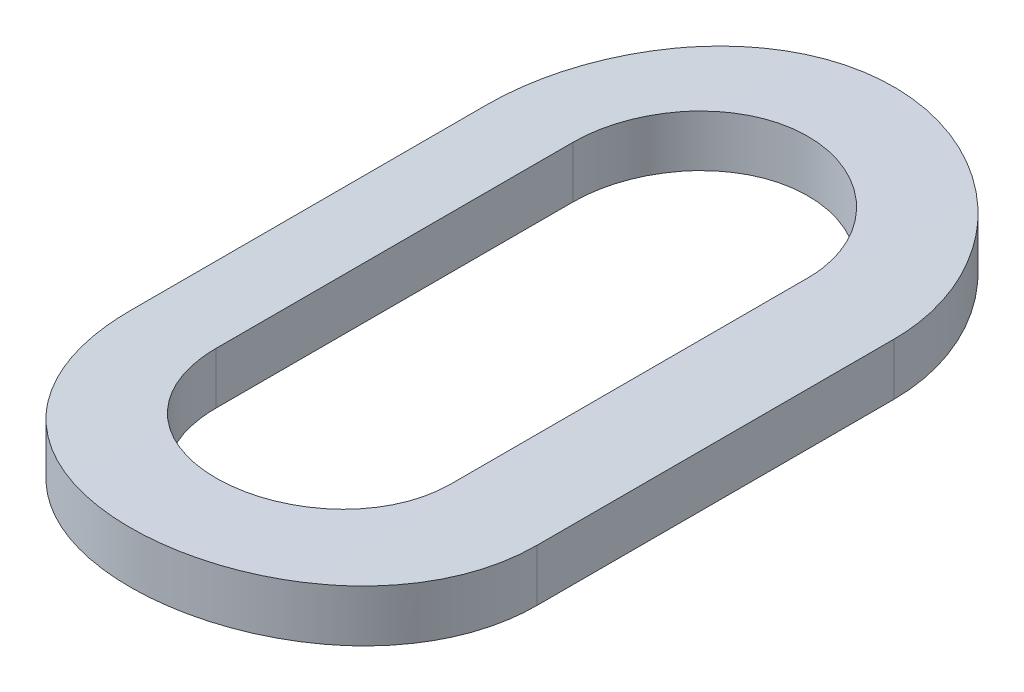
ISO-10303-21;
HEADER;
FILE_DESCRIPTION(('STEP AP214'),'2;1');
FILE_NAME('part.step','',(''),(''),'','','');
FILE_SCHEMA(('AUTOMOTIVE_DESIGN { 1 0 10303 214 1 1 1 1 }'));
ENDSEC;
DATA;
#1=APPLICATION_CONTEXT('core data for automotive mechanical design processes');
#2=APPLICATION_PROTOCOL_DEFINITION('international standard','automotive_design',2000,#1);
#3=PRODUCT_CONTEXT('',#1,'mechanical');
#4=PRODUCT('Part','Part','',(#3));
#5=PRODUCT_RELATED_PRODUCT_CATEGORY('part','',(#4));
#6=PRODUCT_DEFINITION_FORMATION('','',#4);
#7=PRODUCT_DEFINITION_CONTEXT('part definition',#1,'design');
#8=PRODUCT_DEFINITION('design','',#6,#7);
#9=PRODUCT_DEFINITION_SHAPE('','',#8);
#10=(LENGTH_UNIT() NAMED_UNIT(*) SI_UNIT(.MILLI.,.METRE.));
#11=(NAMED_UNIT(*) PLANE_ANGLE_UNIT() SI_UNIT($,.RADIAN.));
#12=(NAMED_UNIT(*) SI_UNIT($,.STERADIAN.) SOLID_ANGLE_UNIT());
#13=UNCERTAINTY_MEASURE_WITH_UNIT(LENGTH_MEASURE(1.E-05),#10,'distance_accuracy_value','');
#14=(GEOMETRIC_REPRESENTATION_CONTEXT(3) GLOBAL_UNCERTAINTY_ASSIGNED_CONTEXT((#13)) GLOBAL_UNIT_ASSIGNED_CONTEXT((#10,
#11,#12)) REPRESENTATION_CONTEXT('',''));
#15=CARTESIAN_POINT('',(0.,0.,0.));
#16=DIRECTION('',(0.,0.,1.));
#17=DIRECTION('',(1.,0.,0.));
#18=AXIS2_PLACEMENT_3D('',#15,#16,#17);
#19=CARTESIAN_POINT('',(-102.183303397109,-58.0021041199526,0.810125243112662));
#20=DIRECTION('',(0.,0.,1.));
#21=DIRECTION('',(1.,0.,0.));
#22=AXIS2_PLACEMENT_3D('',#19,#20,#21);
#23=CYLINDRICAL_SURFACE('',#22,3.15);
#24=CARTESIAN_POINT('',(-102.456886969413,-54.8640072398411,2.08721133480885));
#25=CARTESIAN_POINT('',(-102.45690017744,-54.8640116038495,2.07185098753849));
#26=CARTESIAN_POINT('',(-102.455594165121,-54.8638945821352,2.05649519955441));
#27=CARTESIAN_POINT('',(-102.450441862128,-54.8634501023721,2.0262323754652));
#28=CARTESIAN_POINT('',(-102.446597831778,-54.8631228315755,2.01132495239222));
#29=CARTESIAN_POINT('',(-102.43646531811,-54.8622899162493,1.98236388729178));
#30=CARTESIAN_POINT('',(-102.430175861723,-54.8617842007215,1.96831058770918));
#31=CARTESIAN_POINT('',(-102.415337557483,-54.8606529156442,1.94146074765788));
#32=CARTESIAN_POINT('',(-102.40678902391,-54.8600273627696,1.92866403271426));
#33=CARTESIAN_POINT('',(-102.387649540032,-54.858724650616,1.9046547488766));
#34=CARTESIAN_POINT('',(-102.37705378966,-54.85804737236,1.89344601249384));
#35=CARTESIAN_POINT('',(-102.354129746989,-54.8567186189181,1.87296233994923));
#36=CARTESIAN_POINT('',(-102.341801191367,-54.8560671476734,1.86368769823185));
#37=CARTESIAN_POINT('',(-102.315738757083,-54.8548623045616,1.84732393952189));
#38=CARTESIAN_POINT('',(-102.302002730673,-54.854309086249,1.84023823094363));
#39=CARTESIAN_POINT('',(-102.273531133867,-54.8533644337177,1.82847566534003));
#40=CARTESIAN_POINT('',(-102.258795643014,-54.8529729866417,1.82379861687035));
#41=CARTESIAN_POINT('',(-102.228782091928,-54.8523967862496,1.81699691967461));
#42=CARTESIAN_POINT('',(-102.213505495177,-54.8522115136778,1.8148658578136));
#43=CARTESIAN_POINT('',(-102.182810025518,-54.8520667749048,1.81319678791101));
#44=CARTESIAN_POINT('',(-102.167391151973,-54.8521073097163,1.8136587915003));
#45=CARTESIAN_POINT('',(-102.136893153251,-54.8524091989506,1.81715759303087));
#46=CARTESIAN_POINT('',(-102.121813221565,-54.8526699554928,1.8201874196605));
#47=CARTESIAN_POINT('',(-102.092376822884,-54.8533822737681,1.82872500407471));
#48=CARTESIAN_POINT('',(-102.078020359791,-54.8538338365303,1.83423277522321));
#49=CARTESIAN_POINT('',(-102.050415930298,-54.8548780121511,1.8475777796942));
#50=CARTESIAN_POINT('',(-102.037169500118,-54.8554708162598,1.85541817515618));
#51=CARTESIAN_POINT('',(-102.01217861772,-54.8567308333417,1.87320317503897));
#52=CARTESIAN_POINT('',(-102.000434130094,-54.8573980445601,1.88314772984194));
#53=CARTESIAN_POINT('',(-101.978740535791,-54.8587344683245,1.90489658571906));
#54=CARTESIAN_POINT('',(-101.968797240192,-54.8594036805078,1.91670668389062));
#55=CARTESIAN_POINT('',(-101.951030530104,-54.8606667104951,1.94183564776163));
#56=CARTESIAN_POINT('',(-101.943207767305,-54.8612605050917,1.95515497550358));
#57=CARTESIAN_POINT('',(-101.929903785219,-54.8623058530949,1.98293248532833));
#58=CARTESIAN_POINT('',(-101.924424292344,-54.8627573015633,1.99739149782145));
#59=CARTESIAN_POINT('',(-101.915982962283,-54.863464474176,2.02701140382664));
#60=CARTESIAN_POINT('',(-101.913017308266,-54.8637204949845,2.04217119628175));
#61=CARTESIAN_POINT('',(-101.910259349305,-54.8639604241394,2.06734500879886));
#62=CARTESIAN_POINT('',(-101.909715280934,-54.8640085803269,2.07728065040659));
#63=CARTESIAN_POINT('',(-101.909719824805,-54.8640072398411,2.08721133480885));
#64=B_SPLINE_CURVE_WITH_KNOTS('',3,(#24,#25,#26,#27,#28,#29,#30,#31,#32,#33,#34,#35,#36,#37,#38,
#39,#40,#41,#42,#43,#44,#45,#46,#47,#48,#49,#50,#51,#52,#53,#54,#55,#56,#57,#58,#59,#60,#61,#62,
#63),.UNSPECIFIED.,.F.,.F.,(4,2,2,2,2,2,2,2,2,2,2,2,2,2,2,2,2,2,2,4),(0.,0.0460185269940196,
0.0919961256717319,0.137992038231913,0.183981555270101,0.230080241017502,0.276185939663911,
0.32236307234019,0.368536534213792,0.414593441972178,0.46065055631308,0.506583030539243,
0.552515752488992,0.59851102744619,0.644505217917072,0.690645251790527,0.736799449546955,
0.782987593228109,0.829105481902418,0.858895844339719),.UNSPECIFIED.);
#65=CARTESIAN_POINT('',(-102.456886969413,-54.8640072398411,2.08721133480885));
#66=VERTEX_POINT('',#65);
#67=CARTESIAN_POINT('',(-101.909719824806,-54.8640072398411,2.08721133480885));
#68=VERTEX_POINT('',#67);
#69=EDGE_CURVE('E173',#66,#68,#64,.T.);
#70=ORIENTED_EDGE('',*,*,#69,.T.);
#71=DIRECTION('',(0.,0.,1.));
#72=VECTOR('',#71,1.);
#73=CARTESIAN_POINT('',(-101.909719824806,-54.8640072398411,2.91890539461153));
#74=LINE('',#73,#72);
#75=CARTESIAN_POINT('',(-101.909719824806,-54.8640072398411,2.91890539461153));
#76=VERTEX_POINT('',#75);
#77=EDGE_CURVE('E112',#76,#68,#74,.F.);
#78=ORIENTED_EDGE('',*,*,#77,.F.);
#79=CARTESIAN_POINT('',(-101.909719824805,-54.8640072398411,2.91890539461153));
#80=CARTESIAN_POINT('',(-101.909706616778,-54.8640116038495,2.93426574188189));
#81=CARTESIAN_POINT('',(-101.911012629097,-54.8638945821352,2.94962152986597));
#82=CARTESIAN_POINT('',(-101.91616493209,-54.8634501023721,2.97988435395518));
#83=CARTESIAN_POINT('',(-101.92000896244,-54.8631228315755,2.99479177702816));
#84=CARTESIAN_POINT('',(-101.930141476108,-54.8622899162493,3.0237528421286));
#85=CARTESIAN_POINT('',(-101.936430932495,-54.8617842007215,3.0378061417112));
#86=CARTESIAN_POINT('',(-101.951269236735,-54.8606529156442,3.0646559817625));
#87=CARTESIAN_POINT('',(-101.959817770308,-54.8600273627696,3.07745269670612));
#88=CARTESIAN_POINT('',(-101.978957254186,-54.858724650616,3.10146198054378));
#89=CARTESIAN_POINT('',(-101.989553004558,-54.85804737236,3.11267071692654));
#90=CARTESIAN_POINT('',(-102.012477047229,-54.8567186189181,3.13315438947115));
#91=CARTESIAN_POINT('',(-102.024805602851,-54.8560671476734,3.14242903118853));
#92=CARTESIAN_POINT('',(-102.050868037135,-54.8548623045616,3.15879278989849));
#93=CARTESIAN_POINT('',(-102.064604063545,-54.854309086249,3.16587849847675));
#94=CARTESIAN_POINT('',(-102.093075660351,-54.8533644337177,3.17764106408035));
#95=CARTESIAN_POINT('',(-102.107811151204,-54.8529729866417,3.18231811255003));
#96=CARTESIAN_POINT('',(-102.13782470229,-54.8523967862496,3.18911980974577));
#97=CARTESIAN_POINT('',(-102.153101299041,-54.8522115136778,3.19125087160678));
#98=CARTESIAN_POINT('',(-102.1837967687,-54.8520667749048,3.19291994150937));
#99=CARTESIAN_POINT('',(-102.199215642245,-54.8521073097163,3.19245793792008));
#100=CARTESIAN_POINT('',(-102.229713640967,-54.8524091989506,3.18895913638951));
#101=CARTESIAN_POINT('',(-102.244793572653,-54.8526699554928,3.18592930975988));
#102=CARTESIAN_POINT('',(-102.274229971334,-54.8533822737681,3.17739172534567));
#103=CARTESIAN_POINT('',(-102.288586434427,-54.8538338365303,3.17188395419717));
#104=CARTESIAN_POINT('',(-102.31619086392,-54.8548780121511,3.15853894972618));
#105=CARTESIAN_POINT('',(-102.3294372941,-54.8554708162598,3.15069855426421));
#106=CARTESIAN_POINT('',(-102.354428176498,-54.8567308333417,3.13291355438142));
#107=CARTESIAN_POINT('',(-102.366172664124,-54.8573980445601,3.12296899957844));
#108=CARTESIAN_POINT('',(-102.387866258427,-54.8587344683245,3.10122014370132));
#109=CARTESIAN_POINT('',(-102.397809554026,-54.8594036805078,3.08941004552976));
#110=CARTESIAN_POINT('',(-102.415576264114,-54.8606667104951,3.06428108165875));
#111=CARTESIAN_POINT('',(-102.423399026913,-54.8612605050917,3.0509617539168));
#112=CARTESIAN_POINT('',(-102.436703008999,-54.8623058530949,3.02318424409205));
#113=CARTESIAN_POINT('',(-102.442182501874,-54.8627573015633,3.00872523159893));
#114=CARTESIAN_POINT('',(-102.450623831935,-54.863464474176,2.97910532559373));
#115=CARTESIAN_POINT('',(-102.453589485952,-54.8637204949845,2.96394553313863));
#116=CARTESIAN_POINT('',(-102.456347444913,-54.8639604241394,2.93877172062152));
#117=CARTESIAN_POINT('',(-102.456891513284,-54.8640085803269,2.92883607901379));
#118=CARTESIAN_POINT('',(-102.456886969413,-54.8640072398411,2.91890539461153));
#119=B_SPLINE_CURVE_WITH_KNOTS('',3,(#79,#80,#81,#82,#83,#84,#85,#86,#87,#88,#89,#90,#91,#92,
#93,#94,#95,#96,#97,#98,#99,#100,#101,#102,#103,#104,#105,#106,#107,#108,#109,#110,#111,#112,
#113,#114,#115,#116,#117,#118),.UNSPECIFIED.,.F.,.F.,(4,2,2,2,2,2,2,2,2,2,2,2,2,2,2,2,2,2,2,4),
(0.,0.0460185269940179,0.0919961256717319,0.137992038231913,0.1839815552701,0.230080241017502,
0.27618593966391,0.322363072340189,0.368536534213805,0.414593441972163,0.460650556313079,
0.506583030539257,0.552515752488991,0.598511027446174,0.644505217917071,0.690645251790526,
0.736799449546955,0.782987593228109,0.829105481902419,0.858895844339715),.UNSPECIFIED.);
#120=CARTESIAN_POINT('',(-102.456886969413,-54.8640072398411,2.91890539461153));
#121=VERTEX_POINT('',#120);
#122=EDGE_CURVE('E118',#76,#121,#119,.T.);
#123=ORIENTED_EDGE('',*,*,#122,.T.);
#124=DIRECTION('',(0.,0.,-1.));
#125=VECTOR('',#124,1.);
#126=CARTESIAN_POINT('',(-102.456886969413,-54.8640072398411,2.08721133480885));
#127=LINE('',#126,#125);
#128=EDGE_CURVE('E116',#66,#121,#127,.F.);
#129=ORIENTED_EDGE('',*,*,#128,.F.);
#130=EDGE_LOOP('',(#70,#78,#123,#129));
#131=FACE_BOUND('',#130,.T.);
#132=CARTESIAN_POINT('',(-102.656886969413,-54.8879078191321,2.08721128328014));
#133=CARTESIAN_POINT('',(-102.656910301367,-54.8879209899866,2.06072800978472));
#134=CARTESIAN_POINT('',(-102.654666984042,-54.8875703535478,2.03425491892131));
#135=CARTESIAN_POINT('',(-102.645823316166,-54.8862397001087,1.98209431014276));
#136=CARTESIAN_POINT('',(-102.639228214055,-54.8852604412924,1.95640588488633));
#137=CARTESIAN_POINT('',(-102.621854161786,-54.8827700083915,1.90650589464314));
#138=CARTESIAN_POINT('',(-102.61107410055,-54.8812586930594,1.88229472383434));
#139=CARTESIAN_POINT('',(-102.585650257281,-54.8778791034584,1.83602441539349));
#140=CARTESIAN_POINT('',(-102.571006574309,-54.8760108383419,1.813965222606));
#141=CARTESIAN_POINT('',(-102.538145681472,-54.872110267003,1.77245075183812));
#142=CARTESIAN_POINT('',(-102.519903881795,-54.8700768920678,1.75301503549028));
#143=CARTESIAN_POINT('',(-102.480416013086,-54.8660847856422,1.71746636819289));
#144=CARTESIAN_POINT('',(-102.459169485733,-54.8641260655972,1.70135392507644));
#145=CARTESIAN_POINT('',(-102.41414979167,-54.8604928196409,1.67283873080607));
#146=CARTESIAN_POINT('',(-102.390364968637,-54.8588197053355,1.66045418731288));
#147=CARTESIAN_POINT('',(-102.34102484961,-54.8559582467167,1.63986382882833));
#148=CARTESIAN_POINT('',(-102.315469750316,-54.8547698486461,1.63165755042233));
#149=CARTESIAN_POINT('',(-102.263517193031,-54.8530191933711,1.61971565540127));
#150=CARTESIAN_POINT('',(-102.237127517147,-54.8524522935928,1.61594687490805));
#151=CARTESIAN_POINT('',(-102.184084026339,-54.8519925919177,1.61288395824701));
#152=CARTESIAN_POINT('',(-102.157430219869,-54.8520997685147,1.61358967932185));
#153=CARTESIAN_POINT('',(-102.104842743181,-54.8529724598616,1.61942973120705));
#154=CARTESIAN_POINT('',(-102.078904996217,-54.8537326523978,1.62452826073058));
#155=CARTESIAN_POINT('',(-102.0282576022,-54.8558200203335,1.63895296779947));
#156=CARTESIAN_POINT('',(-102.003547979543,-54.8571472069906,1.64827922928709));
#157=CARTESIAN_POINT('',(-101.955949326915,-54.8602286128493,1.67093149279947));
#158=CARTESIAN_POINT('',(-101.933067610019,-54.8619844434992,1.68427263350979));
#159=CARTESIAN_POINT('',(-101.889855092478,-54.8657273526193,1.7145643166439));
#160=CARTESIAN_POINT('',(-101.869524360235,-54.8677144372873,1.73151495581754));
#161=CARTESIAN_POINT('',(-101.831781270959,-54.8717213079482,1.76874154120146));
#162=CARTESIAN_POINT('',(-101.81439932175,-54.8737412238435,1.78904831673489));
#163=CARTESIAN_POINT('',(-101.783280414676,-54.8775675941592,1.83231307274231));
#164=CARTESIAN_POINT('',(-101.769544513102,-54.8793739866361,1.85527181875676));
#165=CARTESIAN_POINT('',(-101.746101867109,-54.8825697303856,1.90322780983765));
#166=CARTESIAN_POINT('',(-101.736400631495,-54.8839585107526,1.92822778661802));
#167=CARTESIAN_POINT('',(-101.721361617987,-54.8861498267079,1.97949805141153));
#168=CARTESIAN_POINT('',(-101.71601729903,-54.8869532409165,2.00576637221196));
#169=CARTESIAN_POINT('',(-101.710783159375,-54.8877468179874,2.05051955587392));
#170=CARTESIAN_POINT('',(-101.70971019695,-54.8879127395769,2.06886936877038));
#171=CARTESIAN_POINT('',(-101.709719824805,-54.8879078191321,2.08721134128174));
#172=B_SPLINE_CURVE_WITH_KNOTS('',3,(#132,#133,#134,#135,#136,#137,#138,#139,#140,#141,#142,
#143,#144,#145,#146,#147,#148,#149,#150,#151,#152,#153,#154,#155,#156,#157,#158,#159,#160,#161,
#162,#163,#164,#165,#166,#167,#168,#169,#170,#171),.UNSPECIFIED.,.F.,.F.,(4,2,2,2,2,2,2,2,2,2,2,
2,2,2,2,2,2,2,2,4),(0.,0.0793374676678145,0.158579425413,0.237842435761057,0.31710341405488,
0.396926108183828,0.476760991085426,0.556979699293368,0.637189508442637,0.716795981707174,
0.79639991516883,0.875361150025724,0.95432395273868,1.03358830831985,1.11285478878901,
1.1928946190264,1.27295761225969,1.35312956489379,1.43318093210249,1.48819665389926),.UNSPECIFIED.);
#173=CARTESIAN_POINT('',(-102.656886969413,-54.8879078191321,2.0872113090445));
#174=VERTEX_POINT('',#173);
#175=CARTESIAN_POINT('',(-101.709719824806,-54.8879078191321,2.08721133804529));
#176=VERTEX_POINT('',#175);
#177=EDGE_CURVE('E99',#174,#176,#172,.T.);
#178=ORIENTED_EDGE('',*,*,#177,.F.);
#179=DIRECTION('',(0.,0.,1.));
#180=VECTOR('',#179,1.);
#181=CARTESIAN_POINT('',(-102.656886969413,-54.8879078191321,2.91890534282843));
#182=LINE('',#181,#180);
#183=CARTESIAN_POINT('',(-102.656886969413,-54.8879078191321,2.91890534282843));
#184=VERTEX_POINT('',#183);
#185=EDGE_CURVE('E97',#184,#174,#182,.F.);
#186=ORIENTED_EDGE('',*,*,#185,.F.);
#187=CARTESIAN_POINT('',(-101.709719824805,-54.8879078191321,2.9189054334489));
#188=CARTESIAN_POINT('',(-101.709696492141,-54.8879209900947,2.94538870692551));
#189=CARTESIAN_POINT('',(-101.711939808754,-54.8875703537641,2.97186179783272));
#190=CARTESIAN_POINT('',(-101.720783475221,-54.8862397005298,3.02402240681899));
#191=CARTESIAN_POINT('',(-101.727378576636,-54.8852604418102,3.04971083223922));
#192=CARTESIAN_POINT('',(-101.744752627549,-54.8827700090799,3.09961082292558));
#193=CARTESIAN_POINT('',(-101.755532688126,-54.8812586938217,3.12382199401379));
#194=CARTESIAN_POINT('',(-101.780956530128,-54.8778791043379,3.17009230311902));
#195=CARTESIAN_POINT('',(-101.795600212494,-54.8760108392645,3.1921514962915));
#196=CARTESIAN_POINT('',(-101.82846110418,-54.8721102679772,3.23366596792425));
#197=CARTESIAN_POINT('',(-101.846702903313,-54.87007689305,3.2531016847531));
#198=CARTESIAN_POINT('',(-101.886190771018,-54.8660847866036,3.2886503530985));
#199=CARTESIAN_POINT('',(-101.907437297911,-54.8641260665297,3.30476279678194));
#200=CARTESIAN_POINT('',(-101.95245699117,-54.8604928204797,3.3332779922757));
#201=CARTESIAN_POINT('',(-101.976241813863,-54.8588197061096,3.34566253642195));
#202=CARTESIAN_POINT('',(-102.025581932325,-54.8559582473347,3.36625289626134));
#203=CARTESIAN_POINT('',(-102.051137031394,-54.8547698491726,3.37445917536911));
#204=CARTESIAN_POINT('',(-102.103089588371,-54.8530191936987,3.38640107182131));
#205=CARTESIAN_POINT('',(-102.129479264173,-54.8524522938134,3.39016985304053));
#206=CARTESIAN_POINT('',(-102.182522754943,-54.8519925919211,3.39323277115333));
#207=CARTESIAN_POINT('',(-102.209176561457,-54.8520997684079,3.39252705080427));
#208=CARTESIAN_POINT('',(-102.261764038336,-54.8529724595445,3.38668700034412));
#209=CARTESIAN_POINT('',(-102.287701785448,-54.8537326519799,3.38158847152284));
#210=CARTESIAN_POINT('',(-102.338349179874,-54.8558200197335,3.36716376582162));
#211=CARTESIAN_POINT('',(-102.363058802794,-54.8571472063092,3.35783750499952));
#212=CARTESIAN_POINT('',(-102.410657456028,-54.8602286120312,3.33518524277773));
#213=CARTESIAN_POINT('',(-102.433539173271,-54.8619844426256,3.32184410269637));
#214=CARTESIAN_POINT('',(-102.476751691605,-54.8657273516683,3.29155242075598));
#215=CARTESIAN_POINT('',(-102.497082424296,-54.8677144363146,3.27460178214681));
#216=CARTESIAN_POINT('',(-102.534825514566,-54.871721306969,3.23737519781317));
#217=CARTESIAN_POINT('',(-102.552207464321,-54.8737412228799,3.21706842276387));
#218=CARTESIAN_POINT('',(-102.583326372557,-54.8775675932619,3.17380366763829));
#219=CARTESIAN_POINT('',(-102.597062274748,-54.8793739857896,3.15084492202241));
#220=CARTESIAN_POINT('',(-102.620504922046,-54.8825697296737,3.10288893161262));
#221=CARTESIAN_POINT('',(-102.630206158347,-54.8839585101242,3.07788895510332));
#222=CARTESIAN_POINT('',(-102.645245173269,-54.8861498262665,3.02661869071485));
#223=CARTESIAN_POINT('',(-102.650589492949,-54.8869532405778,3.0003503700469));
#224=CARTESIAN_POINT('',(-102.655823636096,-54.8877468181785,2.95559716719595));
#225=CARTESIAN_POINT('',(-102.656896599048,-54.8879127398579,2.93724733477167));
#226=CARTESIAN_POINT('',(-102.656886969413,-54.8879078191321,2.91890534282843));
#227=B_SPLINE_CURVE_WITH_KNOTS('',3,(#187,#188,#189,#190,#191,#192,#193,#194,#195,#196,#197,
#198,#199,#200,#201,#202,#203,#204,#205,#206,#207,#208,#209,#210,#211,#212,#213,#214,#215,#216,
#217,#218,#219,#220,#221,#222,#223,#224,#225,#226),.UNSPECIFIED.,.F.,.F.,(4,2,2,2,2,2,2,2,2,2,2,
2,2,2,2,2,2,2,2,4),(0.,0.0793374676141231,0.158579425305604,0.237842435601438,0.317103413842714,
0.396926107906032,0.476760990742666,0.556979698963243,0.637189508125446,0.716795981460295,
0.796399914992151,0.875361149868448,0.954323952598906,1.0335883081165,1.11285478852878,
1.19289461873174,1.2729576119036,1.35312956452781,1.43318093182725,1.48819671180114),.UNSPECIFIED.);
#228=CARTESIAN_POINT('',(-101.709719824806,-54.8879078191321,2.91890542050311));
#229=VERTEX_POINT('',#228);
#230=EDGE_CURVE('E21',#229,#184,#227,.T.);
#231=ORIENTED_EDGE('',*,*,#230,.F.);
#232=DIRECTION('',(0.,0.,1.));
#233=VECTOR('',#232,1.);
#234=CARTESIAN_POINT('',(-101.709719824806,-54.8879078191321,2.08721138659195));
#235=LINE('',#234,#233);
#236=EDGE_CURVE('E84',#176,#229,#235,.T.);
#237=ORIENTED_EDGE('',*,*,#236,.F.);
#238=EDGE_LOOP('',(#178,#186,#231,#237));
#239=FACE_BOUND('',#238,.T.);
#240=ADVANCED_FACE('F17',(#131,#239),#23,.T.);
#241=CARTESIAN_POINT('',(-102.656886969413,-56.4871041199525,2.91890534282843));
#242=DIRECTION('',(-1.,0.,0.));
#243=DIRECTION('',(0.,-1.,0.));
#244=AXIS2_PLACEMENT_3D('',#241,#242,#243);
#245=PLANE('',#244);
#246=DIRECTION('',(0.,0.,1.));
#247=VECTOR('',#246,1.);
#248=CARTESIAN_POINT('',(-102.656886969413,-55.0093430870527,0.810125243112662));
#249=LINE('',#248,#247);
#250=CARTESIAN_POINT('',(-102.656886969413,-55.0093430870527,2.0872113090445));
#251=VERTEX_POINT('',#250);
#252=CARTESIAN_POINT('',(-102.656886969413,-55.0093430870527,2.91890534282843));
#253=VERTEX_POINT('',#252);
#254=EDGE_CURVE('E106',#251,#253,#249,.T.);
#255=ORIENTED_EDGE('',*,*,#254,.T.);
#256=DIRECTION('',(0.,-1.,0.));
#257=VECTOR('',#256,1.);
#258=CARTESIAN_POINT('',(-102.656886969413,-56.4871041199525,2.91890534282843));
#259=LINE('',#258,#257);
#260=EDGE_CURVE('E93',#184,#253,#259,.T.);
#261=ORIENTED_EDGE('',*,*,#260,.F.);
#262=ORIENTED_EDGE('',*,*,#185,.T.);
#263=DIRECTION('',(0.,-1.,0.));
#264=VECTOR('',#263,1.);
#265=CARTESIAN_POINT('',(-102.656886969413,-56.4871041199525,2.08721128328014));
#266=LINE('',#265,#264);
#267=EDGE_CURVE('E168',#251,#174,#266,.F.);
#268=ORIENTED_EDGE('',*,*,#267,.F.);
#269=EDGE_LOOP('',(#255,#261,#262,#268));
#270=FACE_BOUND('',#269,.T.);
#271=ADVANCED_FACE('F105',(#270),#245,.T.);
#272=CARTESIAN_POINT('',(-102.183303397109,-56.4871041199525,2.91890539461153));
#273=DIRECTION('',(0.,-1.,0.));
#274=DIRECTION('',(1.,0.,0.));
#275=AXIS2_PLACEMENT_3D('',#272,#273,#274);
#276=CYLINDRICAL_SURFACE('',#275,0.473583572303524);
#277=ORIENTED_EDGE('',*,*,#260,.T.);
#278=CARTESIAN_POINT('',(-102.656886969413,-55.0093430870527,2.91890534282843));
#279=CARTESIAN_POINT('',(-102.656910363636,-55.0093567924447,2.94537572435923));
#280=CARTESIAN_POINT('',(-102.654669167827,-55.0089922713787,2.97183564405388));
#281=CARTESIAN_POINT('',(-102.645834625523,-55.0076090712904,3.02396885056969));
#282=CARTESIAN_POINT('',(-102.639246687327,-55.0065912052151,3.04964307348531));
#283=CARTESIAN_POINT('',(-102.621892725166,-55.0040028168435,3.09951478180984));
#284=CARTESIAN_POINT('',(-102.611125659239,-55.002432156731,3.12371189719645));
#285=CARTESIAN_POINT('',(-102.585733539559,-54.9989200165159,3.16995692314192));
#286=CARTESIAN_POINT('',(-102.571108532031,-54.9969785408566,3.1920048594478));
#287=CARTESIAN_POINT('',(-102.538280468545,-54.9929238710529,3.2335135406591));
#288=CARTESIAN_POINT('',(-102.520050862986,-54.9908094754672,3.25295317410641));
#289=CARTESIAN_POINT('',(-102.480586793426,-54.9866579482435,3.28851269086282));
#290=CARTESIAN_POINT('',(-102.459351870567,-54.9846208284646,3.30463206630353));
#291=CARTESIAN_POINT('',(-102.414343908605,-54.9808407892872,3.33317021009916));
#292=CARTESIAN_POINT('',(-102.390558222779,-54.9790994579058,3.34556926151314));
#293=CARTESIAN_POINT('',(-102.341211460188,-54.9761207620847,3.36618755838455));
#294=CARTESIAN_POINT('',(-102.31565058753,-54.9748833398185,3.37440728346892));
#295=CARTESIAN_POINT('',(-102.26369801958,-54.9730602946523,3.38636968506125));
#296=CARTESIAN_POINT('',(-102.237314756473,-54.972469460444,3.39014817520748));
#297=CARTESIAN_POINT('',(-102.184281897046,-54.9719882800269,3.39323213298421));
#298=CARTESIAN_POINT('',(-102.157632310421,-54.9720979084121,3.39253776284705));
#299=CARTESIAN_POINT('',(-102.105069212046,-54.9730011773732,3.38672368706659));
#300=CARTESIAN_POINT('',(-102.079151307289,-54.9737888429389,3.38164263665566));
#301=CARTESIAN_POINT('',(-102.028540720233,-54.9759530172036,3.36726021345518));
#302=CARTESIAN_POINT('',(-102.00384806415,-54.9773295384964,3.35795875040414));
#303=CARTESIAN_POINT('',(-101.956272059242,-54.9805270244874,3.335360190867));
#304=CARTESIAN_POINT('',(-101.933396540101,-54.9823497874977,3.32204687557696));
#305=CARTESIAN_POINT('',(-101.890190559301,-54.9862367270591,3.29181494989964));
#306=CARTESIAN_POINT('',(-101.869860181182,-54.9883009115301,3.27489622121942));
#307=CARTESIAN_POINT('',(-101.832094921823,-54.9924666020471,3.23772106337597));
#308=CARTESIAN_POINT('',(-101.814692859598,-54.9945682720704,3.21743129676838));
#309=CARTESIAN_POINT('',(-101.783530612499,-54.9985512918196,3.17419595129348));
#310=CARTESIAN_POINT('',(-101.769771476698,-55.0004325779935,3.15124961012672));
#311=CARTESIAN_POINT('',(-101.746278812961,-55.0037628592246,3.10330958654772));
#312=CARTESIAN_POINT('',(-101.736551233365,-55.0052112146448,3.07831294365904));
#313=CARTESIAN_POINT('',(-101.72146024664,-55.0074985019123,3.02704253624398));
#314=CARTESIAN_POINT('',(-101.716090303962,-55.0083383461964,3.00077074712894));
#315=CARTESIAN_POINT('',(-101.710799366596,-55.0091729918481,2.95587535888896));
#316=CARTESIAN_POINT('',(-101.70970996762,-55.0093483254302,2.93738654282071));
#317=CARTESIAN_POINT('',(-101.709719824805,-55.0093430870527,2.9189054334489));
#318=B_SPLINE_CURVE_WITH_KNOTS('',3,(#278,#279,#280,#281,#282,#283,#284,#285,#286,#287,#288,
#289,#290,#291,#292,#293,#294,#295,#296,#297,#298,#299,#300,#301,#302,#303,#304,#305,#306,#307,
#308,#309,#310,#311,#312,#313,#314,#315,#316,#317),.UNSPECIFIED.,.F.,.F.,(4,2,2,2,2,2,2,2,2,2,2,
2,2,2,2,2,2,2,2,4),(0.,0.0792982860291026,0.158498093207799,0.23771765957172,0.316936276773922,
0.396761705769602,0.476599335852236,0.556852904139629,0.637097260304516,0.716689995968153,
0.796279844789056,0.875175427850119,0.954072698321892,1.03329330798992,1.11251651727183,
1.19257573875596,1.27265799030134,1.35285798175018,1.43293746642569,1.48836957012091),.UNSPECIFIED.);
#319=CARTESIAN_POINT('',(-101.709719824806,-55.0093430870526,2.91890542050311));
#320=VERTEX_POINT('',#319);
#321=EDGE_CURVE('E150',#253,#320,#318,.T.);
#322=ORIENTED_EDGE('',*,*,#321,.T.);
#323=DIRECTION('',(0.,1.,0.));
#324=VECTOR('',#323,1.);
#325=CARTESIAN_POINT('',(-101.709719824806,-56.4871041199525,2.9189054463947));
#326=LINE('',#325,#324);
#327=EDGE_CURVE('E95',#229,#320,#326,.F.);
#328=ORIENTED_EDGE('',*,*,#327,.F.);
#329=ORIENTED_EDGE('',*,*,#230,.T.);
#330=EDGE_LOOP('',(#277,#322,#328,#329));
#331=FACE_BOUND('',#330,.T.);
#332=ADVANCED_FACE('F90',(#331),#276,.T.);
#333=CARTESIAN_POINT('',(-101.709719824806,-56.4871041199525,2.08721138659195));
#334=DIRECTION('',(1.,0.,0.));
#335=DIRECTION('',(0.,1.,0.));
#336=AXIS2_PLACEMENT_3D('',#333,#334,#335);
#337=PLANE('',#336);
#338=DIRECTION('',(0.,0.,1.));
#339=VECTOR('',#338,1.);
#340=CARTESIAN_POINT('',(-101.709719824806,-55.0093430870526,0.810125243112662));
#341=LINE('',#340,#339);
#342=CARTESIAN_POINT('',(-101.709719824806,-55.0093430870526,2.08721133804529));
#343=VERTEX_POINT('',#342);
#344=EDGE_CURVE('E149',#320,#343,#341,.F.);
#345=ORIENTED_EDGE('',*,*,#344,.T.);
#346=DIRECTION('',(0.,-1.,0.));
#347=VECTOR('',#346,1.);
#348=CARTESIAN_POINT('',(-101.709719824805,-56.4871041199525,2.08721133480885));
#349=LINE('',#348,#347);
#350=EDGE_CURVE('E115',#176,#343,#349,.T.);
#351=ORIENTED_EDGE('',*,*,#350,.F.);
#352=ORIENTED_EDGE('',*,*,#236,.T.);
#353=ORIENTED_EDGE('',*,*,#327,.T.);
#354=EDGE_LOOP('',(#345,#351,#352,#353));
#355=FACE_BOUND('',#354,.T.);
#356=ADVANCED_FACE('F161',(#355),#337,.T.);
#357=CARTESIAN_POINT('',(-102.183303397109,-56.4871041199525,2.08721133480885));
#358=DIRECTION('',(0.,-1.,0.));
#359=DIRECTION('',(1.,0.,0.));
#360=AXIS2_PLACEMENT_3D('',#357,#358,#359);
#361=CYLINDRICAL_SURFACE('',#360,0.473583572303524);
#362=ORIENTED_EDGE('',*,*,#350,.T.);
#363=CARTESIAN_POINT('',(-101.709719824805,-55.0093430870527,2.08721134128174));
#364=CARTESIAN_POINT('',(-101.709696433115,-55.0093567920431,2.06074095967844));
#365=CARTESIAN_POINT('',(-101.711937631467,-55.0089922705753,2.03428104013522));
#366=CARTESIAN_POINT('',(-101.720772178799,-55.0076090697261,1.98214783435167));
#367=CARTESIAN_POINT('',(-101.727360119481,-55.0065912032917,1.95647361201637));
#368=CARTESIAN_POINT('',(-101.744714086487,-55.0040028142859,1.90660190526567));
#369=CARTESIAN_POINT('',(-101.755481154771,-55.0024321538984,1.88240479087255));
#370=CARTESIAN_POINT('',(-101.780873278977,-54.9989200132476,1.83615976729106));
#371=CARTESIAN_POINT('',(-101.795498288673,-54.9969785374274,1.81411183235569));
#372=CARTESIAN_POINT('',(-101.828326356277,-54.9929238674313,1.77260315422425));
#373=CARTESIAN_POINT('',(-101.846555963785,-54.990809471815,1.75316352249063));
#374=CARTESIAN_POINT('',(-101.886020036948,-54.9866579446673,1.71760400947031));
#375=CARTESIAN_POINT('',(-101.90725496146,-54.9846208249948,1.70148463605195));
#376=CARTESIAN_POINT('',(-101.952262926303,-54.9808407861651,1.67294649662774));
#377=CARTESIAN_POINT('',(-101.976048613347,-54.9790994550245,1.66054744754988));
#378=CARTESIAN_POINT('',(-102.025395377963,-54.9761207597839,1.63992915552563));
#379=CARTESIAN_POINT('',(-102.050956251429,-54.9748833378576,1.63170943295221));
#380=CARTESIAN_POINT('',(-102.102908820474,-54.9730602934315,1.61974703648071));
#381=CARTESIAN_POINT('',(-102.129292083869,-54.9724694596212,1.61596854893136));
#382=CARTESIAN_POINT('',(-102.182324943423,-54.9719882800114,1.6128845963456));
#383=CARTESIAN_POINT('',(-102.208974529888,-54.9720979088058,1.6135789690769));
#384=CARTESIAN_POINT('',(-102.26153762757,-54.9730011785483,1.61939304994751));
#385=CARTESIAN_POINT('',(-102.287455531798,-54.9737888444881,1.624474102866));
#386=CARTESIAN_POINT('',(-102.338066117387,-54.9759530194293,1.63885653094899));
#387=CARTESIAN_POINT('',(-102.362758772532,-54.9773295410245,1.64815799637517));
#388=CARTESIAN_POINT('',(-102.410334775278,-54.9805270275236,1.67075656052041));
#389=CARTESIAN_POINT('',(-102.433210293186,-54.982349790741,1.68406987805796));
#390=CARTESIAN_POINT('',(-102.476416271163,-54.9862367305918,1.71430180800536));
#391=CARTESIAN_POINT('',(-102.496746647691,-54.9883009151451,1.73122053870784));
#392=CARTESIAN_POINT('',(-102.53451190352,-54.9924666056903,1.76839570032618));
#393=CARTESIAN_POINT('',(-102.551913963804,-54.9945682756581,1.78868546868116));
#394=CARTESIAN_POINT('',(-102.583076206754,-54.9985512951627,1.83192081732362));
#395=CARTESIAN_POINT('',(-102.596835340346,-55.0004325811476,1.85486715991129));
#396=CARTESIAN_POINT('',(-102.620327999393,-55.0037628618773,1.90280718585594));
#397=CARTESIAN_POINT('',(-102.630055576523,-55.0052112169866,1.92780382968116));
#398=CARTESIAN_POINT('',(-102.645146558192,-55.0074985035563,1.97907423851768));
#399=CARTESIAN_POINT('',(-102.650516498285,-55.0083383474543,2.00534602811663));
#400=CARTESIAN_POINT('',(-102.655807428936,-55.0091729920558,2.05024139725421));
#401=CARTESIAN_POINT('',(-102.656896826077,-55.0093483253369,2.06873019360613));
#402=CARTESIAN_POINT('',(-102.656886969413,-55.0093430870527,2.08721128328014));
#403=B_SPLINE_CURVE_WITH_KNOTS('',3,(#363,#364,#365,#366,#367,#368,#369,#370,#371,#372,#373,
#374,#375,#376,#377,#378,#379,#380,#381,#382,#383,#384,#385,#386,#387,#388,#389,#390,#391,#392,
#393,#394,#395,#396,#397,#398,#399,#400,#401,#402),.UNSPECIFIED.,.F.,.F.,(4,2,2,2,2,2,2,2,2,2,2,
2,2,2,2,2,2,2,2,4),(0.,0.0792982862364216,0.158498093622461,0.23771766018792,0.316936277593047,
0.396761706842616,0.476599337176396,0.556852905415224,0.637097261530253,0.716689996921955,
0.796279845472059,0.875175428459883,0.954072698861754,1.03329330876507,1.11251651827549,
1.19257573993309,1.27265799167701,1.35285798302064,1.43293746749066,1.48836951221934),.UNSPECIFIED.);
#404=EDGE_CURVE('E142',#343,#251,#403,.T.);
#405=ORIENTED_EDGE('',*,*,#404,.T.);
#406=ORIENTED_EDGE('',*,*,#267,.T.);
#407=ORIENTED_EDGE('',*,*,#177,.T.);
#408=EDGE_LOOP('',(#362,#405,#406,#407));
#409=FACE_BOUND('',#408,.T.);
#410=ADVANCED_FACE('F155',(#409),#361,.T.);
#411=CARTESIAN_POINT('',(-101.909719824806,-56.4871041199525,2.91890539461153));
#412=DIRECTION('',(-1.,0.,0.));
#413=DIRECTION('',(0.,-1.,0.));
#414=AXIS2_PLACEMENT_3D('',#411,#412,#413);
#415=PLANE('',#414);
#416=DIRECTION('',(0.,0.,1.));
#417=VECTOR('',#416,1.);
#418=CARTESIAN_POINT('',(-101.909719824806,-54.9844805468465,0.810125243112662));
#419=LINE('',#418,#417);
#420=CARTESIAN_POINT('',(-101.909719824806,-54.9844805468465,2.08721133480885));
#421=VERTEX_POINT('',#420);
#422=CARTESIAN_POINT('',(-101.909719824806,-54.9844805468465,2.91890539461153));
#423=VERTEX_POINT('',#422);
#424=EDGE_CURVE('E148',#421,#423,#419,.T.);
#425=ORIENTED_EDGE('',*,*,#424,.T.);
#426=DIRECTION('',(0.,-1.,0.));
#427=VECTOR('',#426,1.);
#428=CARTESIAN_POINT('',(-101.909719824805,-56.4871041199525,2.91890539461153));
#429=LINE('',#428,#427);
#430=EDGE_CURVE('E114',#423,#76,#429,.F.);
#431=ORIENTED_EDGE('',*,*,#430,.T.);
#432=ORIENTED_EDGE('',*,*,#77,.T.);
#433=DIRECTION('',(0.,-1.,0.));
#434=VECTOR('',#433,1.);
#435=CARTESIAN_POINT('',(-101.909719824805,-56.4871041199525,2.08721133480885));
#436=LINE('',#435,#434);
#437=EDGE_CURVE('E201',#68,#421,#436,.T.);
#438=ORIENTED_EDGE('',*,*,#437,.T.);
#439=EDGE_LOOP('',(#425,#431,#432,#438));
#440=FACE_BOUND('',#439,.T.);
#441=ADVANCED_FACE('F160',(#440),#415,.T.);
#442=CARTESIAN_POINT('',(-102.183303397109,-56.4871041199525,2.91890539461153));
#443=DIRECTION('',(0.,-1.,0.));
#444=DIRECTION('',(1.,0.,0.));
#445=AXIS2_PLACEMENT_3D('',#442,#443,#444);
#446=CYLINDRICAL_SURFACE('',#445,0.273583572303518);
#447=DIRECTION('',(0.,1.,0.));
#448=VECTOR('',#447,1.);
#449=CARTESIAN_POINT('',(-102.456886969413,-56.4871041199525,2.91890539461153));
#450=LINE('',#449,#448);
#451=CARTESIAN_POINT('',(-102.456886969413,-54.9844805468465,2.91890539461153));
#452=VERTEX_POINT('',#451);
#453=EDGE_CURVE('E117',#121,#452,#450,.F.);
#454=ORIENTED_EDGE('',*,*,#453,.F.);
#455=ORIENTED_EDGE('',*,*,#122,.F.);
#456=ORIENTED_EDGE('',*,*,#430,.F.);
#457=CARTESIAN_POINT('',(-101.909719824805,-54.9844805468465,2.91890539461153));
#458=CARTESIAN_POINT('',(-101.909706605658,-54.9844850850066,2.9342632679719));
#459=CARTESIAN_POINT('',(-101.911012210473,-54.9843634291541,2.94961652885524));
#460=CARTESIAN_POINT('',(-101.916162756661,-54.9839013638385,2.97987409353087));
#461=CARTESIAN_POINT('',(-101.920005406143,-54.9835611518201,2.9947787898485));
#462=CARTESIAN_POINT('',(-101.930134044468,-54.982695325965,3.02373442762964));
#463=CARTESIAN_POINT('',(-101.936420992914,-54.9821696393207,3.03778503127833));
#464=CARTESIAN_POINT('',(-101.951253172458,-54.9809936958497,3.06463003077976));
#465=CARTESIAN_POINT('',(-101.959798099861,-54.9803434557786,3.07742459525052));
#466=CARTESIAN_POINT('',(-101.978931274905,-54.9789891929714,3.10143281801007));
#467=CARTESIAN_POINT('',(-101.989524705438,-54.9782850366116,3.11264233874826));
#468=CARTESIAN_POINT('',(-102.01244423575,-54.976903511139,3.13312815470853));
#469=CARTESIAN_POINT('',(-102.024770598873,-54.9762261461177,3.14240415557363));
#470=CARTESIAN_POINT('',(-102.050830830711,-54.9749732653347,3.15877232350368));
#471=CARTESIAN_POINT('',(-102.064567028138,-54.9743979225072,3.16586079734273));
#472=CARTESIAN_POINT('',(-102.093039900517,-54.9734154280022,3.17762868466399));
#473=CARTESIAN_POINT('',(-102.107776494586,-54.9730082627462,3.18230829264109));
#474=CARTESIAN_POINT('',(-102.137789954603,-54.9724089065577,3.18911389149589));
#475=CARTESIAN_POINT('',(-102.153065236644,-54.9722161320768,3.19124681534238));
#476=CARTESIAN_POINT('',(-102.18375848949,-54.9720652956585,3.19291995032177));
#477=CARTESIAN_POINT('',(-102.199176460722,-54.972107234425,3.19246015367979));
#478=CARTESIAN_POINT('',(-102.229669558058,-54.9724206277345,3.18896646039296));
#479=CARTESIAN_POINT('',(-102.244745554765,-54.9726914108666,3.18594009376702));
#480=CARTESIAN_POINT('',(-102.274174660857,-54.9734312715637,3.17741089924429));
#481=CARTESIAN_POINT('',(-102.288527765871,-54.9739003503275,3.17190805637759));
#482=CARTESIAN_POINT('',(-102.316127881446,-54.9749852107613,3.15857364552072));
#483=CARTESIAN_POINT('',(-102.329373238902,-54.9756012065815,3.15073867398601));
#484=CARTESIAN_POINT('',(-102.354363137426,-54.9769106737635,3.13296527765184));
#485=CARTESIAN_POINT('',(-102.366107710778,-54.9776041434581,3.12302689811185));
#486=CARTESIAN_POINT('',(-102.387805918562,-54.9789935419706,3.10128783989934));
#487=CARTESIAN_POINT('',(-102.397753257335,-54.9796894710466,3.08948087650378));
#488=CARTESIAN_POINT('',(-102.41552860711,-54.9810031213351,3.06435723079186));
#489=CARTESIAN_POINT('',(-102.423355968339,-54.9816208185386,3.05104008737605));
#490=CARTESIAN_POINT('',(-102.43666961025,-54.9827084570826,3.02326549613379));
#491=CARTESIAN_POINT('',(-102.44215412786,-54.9831782870781,3.00880719920938));
#492=CARTESIAN_POINT('',(-102.45060539616,-54.9839144740036,2.97918744791641));
#493=CARTESIAN_POINT('',(-102.453575961733,-54.9841811391716,2.96402709591581));
#494=CARTESIAN_POINT('',(-102.45634450532,-54.9844315961996,2.9388257156651));
#495=CARTESIAN_POINT('',(-102.456891551668,-54.9844819522347,2.92886308187297));
#496=CARTESIAN_POINT('',(-102.456886969413,-54.9844805468465,2.91890539461153));
#497=B_SPLINE_CURVE_WITH_KNOTS('',3,(#457,#458,#459,#460,#461,#462,#463,#464,#465,#466,#467,
#468,#469,#470,#471,#472,#473,#474,#475,#476,#477,#478,#479,#480,#481,#482,#483,#484,#485,#486,
#487,#488,#489,#490,#491,#492,#493,#494,#495,#496),.UNSPECIFIED.,.F.,.F.,(4,2,2,2,2,2,2,2,2,2,2,
2,2,2,2,2,2,2,2,4),(0.,0.0460110092394269,0.0919805102672458,0.137968076626713,
0.183949460880798,0.230048741249598,0.276155034605758,0.32233874916102,0.368518734199204,
0.414572712346595,0.460626828597784,0.506546292990866,0.552466034963513,0.598453124267894,
0.644439224158955,0.690583414231277,0.736741731520297,0.782934723603292,0.829057492186303,
0.85892871626179),.UNSPECIFIED.);
#498=EDGE_CURVE('E125',#423,#452,#497,.T.);
#499=ORIENTED_EDGE('',*,*,#498,.T.);
#500=EDGE_LOOP('',(#454,#455,#456,#499));
#501=FACE_BOUND('',#500,.T.);
#502=ADVANCED_FACE('F177',(#501),#446,.F.);
#503=CARTESIAN_POINT('',(-102.456886969413,-56.4871041199525,2.08721133480885));
#504=DIRECTION('',(1.,0.,0.));
#505=DIRECTION('',(0.,0.,-1.));
#506=AXIS2_PLACEMENT_3D('',#503,#504,#505);
#507=PLANE('',#506);
#508=DIRECTION('',(0.,0.,1.));
#509=VECTOR('',#508,1.);
#510=CARTESIAN_POINT('',(-102.456886969413,-54.9844805468465,0.810125243112662));
#511=LINE('',#510,#509);
#512=CARTESIAN_POINT('',(-102.456886969413,-54.9844805468465,2.08721133480885));
#513=VERTEX_POINT('',#512);
#514=EDGE_CURVE('E31',#452,#513,#511,.F.);
#515=ORIENTED_EDGE('',*,*,#514,.T.);
#516=DIRECTION('',(0.,-1.,0.));
#517=VECTOR('',#516,1.);
#518=CARTESIAN_POINT('',(-102.456886969413,-56.4871041199525,2.08721133480885));
#519=LINE('',#518,#517);
#520=EDGE_CURVE('E39',#513,#66,#519,.F.);
#521=ORIENTED_EDGE('',*,*,#520,.T.);
#522=ORIENTED_EDGE('',*,*,#128,.T.);
#523=ORIENTED_EDGE('',*,*,#453,.T.);
#524=EDGE_LOOP('',(#515,#521,#522,#523));
#525=FACE_BOUND('',#524,.T.);
#526=ADVANCED_FACE('F180',(#525),#507,.T.);
#527=CARTESIAN_POINT('',(-102.183303397109,-56.4871041199525,2.08721133480885));
#528=DIRECTION('',(0.,-1.,0.));
#529=DIRECTION('',(1.,0.,0.));
#530=AXIS2_PLACEMENT_3D('',#527,#528,#529);
#531=CYLINDRICAL_SURFACE('',#530,0.273583572303518);
#532=ORIENTED_EDGE('',*,*,#437,.F.);
#533=ORIENTED_EDGE('',*,*,#69,.F.);
#534=ORIENTED_EDGE('',*,*,#520,.F.);
#535=CARTESIAN_POINT('',(-102.456886969413,-54.9844805468465,2.08721133480885));
#536=CARTESIAN_POINT('',(-102.45690018856,-54.9844850850065,2.07185346144848));
#537=CARTESIAN_POINT('',(-102.455594583745,-54.9843634291541,2.05650020056515));
#538=CARTESIAN_POINT('',(-102.450444037557,-54.9839013638385,2.02624263588951));
#539=CARTESIAN_POINT('',(-102.446601388075,-54.9835611518201,2.01133793957188));
#540=CARTESIAN_POINT('',(-102.43647274975,-54.982695325965,1.98238230179074));
#541=CARTESIAN_POINT('',(-102.430185801304,-54.9821696393207,1.96833169814205));
#542=CARTESIAN_POINT('',(-102.41535362176,-54.9809936958497,1.94148669864062));
#543=CARTESIAN_POINT('',(-102.406808694357,-54.9803434557786,1.92869213416986));
#544=CARTESIAN_POINT('',(-102.387675519313,-54.9789891929714,1.90468391141031));
#545=CARTESIAN_POINT('',(-102.37708208878,-54.9782850366116,1.89347439067212));
#546=CARTESIAN_POINT('',(-102.354162558468,-54.976903511139,1.87298857471185));
#547=CARTESIAN_POINT('',(-102.341836195345,-54.9762261461177,1.86371257384675));
#548=CARTESIAN_POINT('',(-102.315775963507,-54.9749732653347,1.8473444059167));
#549=CARTESIAN_POINT('',(-102.30203976608,-54.9743979225072,1.84025593207765));
#550=CARTESIAN_POINT('',(-102.273566893701,-54.9734154280022,1.82848804475639));
#551=CARTESIAN_POINT('',(-102.258830299632,-54.9730082627462,1.82380843677929));
#552=CARTESIAN_POINT('',(-102.228816839615,-54.9724089065577,1.81700283792449));
#553=CARTESIAN_POINT('',(-102.213541557574,-54.9722161320768,1.814869914078));
#554=CARTESIAN_POINT('',(-102.182848304728,-54.9720652956585,1.81319677909861));
#555=CARTESIAN_POINT('',(-102.167430333496,-54.972107234425,1.81365657574059));
#556=CARTESIAN_POINT('',(-102.13693723616,-54.9724206277345,1.81715026902742));
#557=CARTESIAN_POINT('',(-102.121861239453,-54.9726914108666,1.82017663565336));
#558=CARTESIAN_POINT('',(-102.092432133361,-54.9734312715637,1.8287058301761));
#559=CARTESIAN_POINT('',(-102.078079028347,-54.9739003503275,1.83420867304279));
#560=CARTESIAN_POINT('',(-102.050478912772,-54.9749852107613,1.84754308389966));
#561=CARTESIAN_POINT('',(-102.037233555316,-54.9756012065815,1.85537805543437));
#562=CARTESIAN_POINT('',(-102.012243656792,-54.9769106737635,1.87315145176855));
#563=CARTESIAN_POINT('',(-102.00049908344,-54.9776041434581,1.88308983130853));
#564=CARTESIAN_POINT('',(-101.978800875656,-54.9789935419706,1.90482888952104));
#565=CARTESIAN_POINT('',(-101.968853536883,-54.9796894710466,1.91663585291659));
#566=CARTESIAN_POINT('',(-101.951078187108,-54.9810031213351,1.94175949862851));
#567=CARTESIAN_POINT('',(-101.943250825879,-54.9816208185386,1.95507664204432));
#568=CARTESIAN_POINT('',(-101.929937183968,-54.9827084570826,1.98285123328659));
#569=CARTESIAN_POINT('',(-101.924452666358,-54.9831782870781,1.997309530211));
#570=CARTESIAN_POINT('',(-101.916001398058,-54.9839144740036,2.02692928150397));
#571=CARTESIAN_POINT('',(-101.913030832485,-54.9841811391716,2.04208963350457));
#572=CARTESIAN_POINT('',(-101.910262288898,-54.9844315961996,2.06729101375528));
#573=CARTESIAN_POINT('',(-101.90971524255,-54.9844819522347,2.07725364754741));
#574=CARTESIAN_POINT('',(-101.909719824805,-54.9844805468465,2.08721133480885));
#575=B_SPLINE_CURVE_WITH_KNOTS('',3,(#535,#536,#537,#538,#539,#540,#541,#542,#543,#544,#545,
#546,#547,#548,#549,#550,#551,#552,#553,#554,#555,#556,#557,#558,#559,#560,#561,#562,#563,#564,
#565,#566,#567,#568,#569,#570,#571,#572,#573,#574),.UNSPECIFIED.,.F.,.F.,(4,2,2,2,2,2,2,2,2,2,2,
2,2,2,2,2,2,2,2,4),(0.,0.0460110092394272,0.0919805102672439,0.137968076626716,
0.183949460880793,0.230048741249593,0.276155034605753,0.322338749161015,0.368518734199199,
0.414572712346604,0.460626828597779,0.50654629299089,0.552466034963508,0.598453124267904,
0.64443922415895,0.690583414231254,0.736741731520296,0.782934723603283,0.829057492186293,
0.858928716261785),.UNSPECIFIED.);
#576=EDGE_CURVE('E11',#513,#421,#575,.T.);
#577=ORIENTED_EDGE('',*,*,#576,.T.);
#578=EDGE_LOOP('',(#532,#533,#534,#577));
#579=FACE_BOUND('',#578,.T.);
#580=ADVANCED_FACE('F131',(#579),#531,.F.);
#581=CARTESIAN_POINT('',(-102.183303397109,-58.0021041199526,0.810125243112662));
#582=DIRECTION('',(0.,0.,1.));
#583=DIRECTION('',(1.,0.,0.));
#584=AXIS2_PLACEMENT_3D('',#581,#582,#583);
#585=CYLINDRICAL_SURFACE('',#584,3.03);
#586=ORIENTED_EDGE('',*,*,#514,.F.);
#587=ORIENTED_EDGE('',*,*,#498,.F.);
#588=ORIENTED_EDGE('',*,*,#424,.F.);
#589=ORIENTED_EDGE('',*,*,#576,.F.);
#590=EDGE_LOOP('',(#586,#587,#588,#589));
#591=FACE_BOUND('',#590,.T.);
#592=ORIENTED_EDGE('',*,*,#344,.F.);
#593=ORIENTED_EDGE('',*,*,#321,.F.);
#594=ORIENTED_EDGE('',*,*,#254,.F.);
#595=ORIENTED_EDGE('',*,*,#404,.F.);
#596=EDGE_LOOP('',(#592,#593,#594,#595));
#597=FACE_BOUND('',#596,.T.);
#598=ADVANCED_FACE('F134',(#591,#597),#585,.F.);
#599=CLOSED_SHELL('',(#240,#271,#332,#356,#410,#441,#502,#526,#580,#598));
#600=MANIFOLD_SOLID_BREP('B1',#599);
#601=ADVANCED_BREP_SHAPE_REPRESENTATION('',(#18,#600),#14);
#602=SHAPE_DEFINITION_REPRESENTATION(#9,#601);
ENDSEC;
END-ISO-10303-21;
